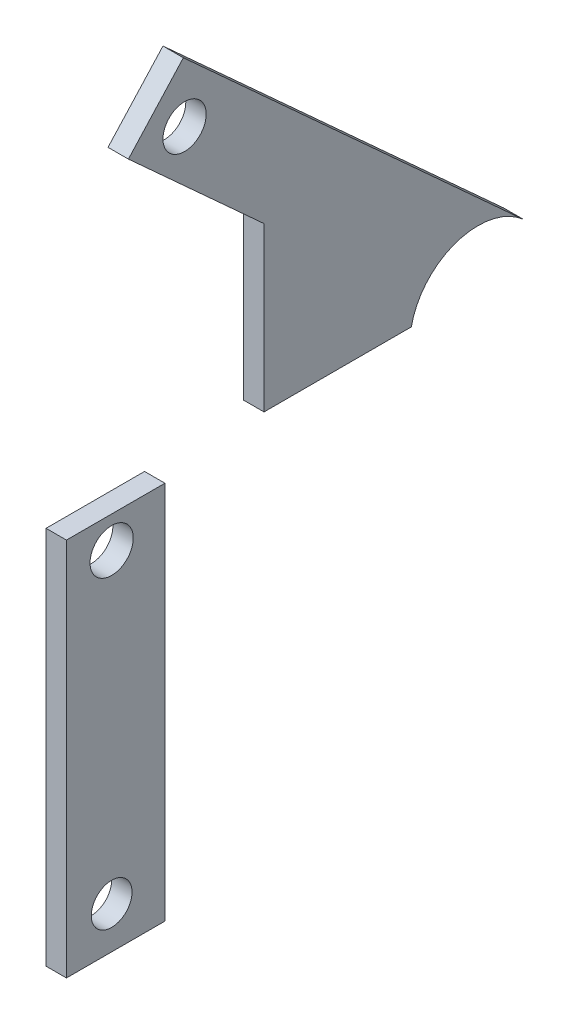
ISO-10303-21;
HEADER;
FILE_DESCRIPTION(('STEP AP214'),'2;1');
FILE_NAME('part.step','',(''),(''),'','','');
FILE_SCHEMA(('AUTOMOTIVE_DESIGN { 1 0 10303 214 1 1 1 1 }'));
ENDSEC;
DATA;
#1=APPLICATION_CONTEXT('core data for automotive mechanical design processes');
#2=APPLICATION_PROTOCOL_DEFINITION('international standard','automotive_design',2000,#1);
#3=PRODUCT_CONTEXT('',#1,'mechanical');
#4=PRODUCT('Part','Part','',(#3));
#5=PRODUCT_RELATED_PRODUCT_CATEGORY('part','',(#4));
#6=PRODUCT_DEFINITION_FORMATION('','',#4);
#7=PRODUCT_DEFINITION_CONTEXT('part definition',#1,'design');
#8=PRODUCT_DEFINITION('design','',#6,#7);
#9=PRODUCT_DEFINITION_SHAPE('','',#8);
#10=(LENGTH_UNIT() NAMED_UNIT(*) SI_UNIT(.MILLI.,.METRE.));
#11=(NAMED_UNIT(*) PLANE_ANGLE_UNIT() SI_UNIT($,.RADIAN.));
#12=(NAMED_UNIT(*) SI_UNIT($,.STERADIAN.) SOLID_ANGLE_UNIT());
#13=UNCERTAINTY_MEASURE_WITH_UNIT(LENGTH_MEASURE(1.E-05),#10,'distance_accuracy_value','');
#14=(GEOMETRIC_REPRESENTATION_CONTEXT(3) GLOBAL_UNCERTAINTY_ASSIGNED_CONTEXT((#13)) GLOBAL_UNIT_ASSIGNED_CONTEXT((#10,
#11,#12)) REPRESENTATION_CONTEXT('',''));
#15=CARTESIAN_POINT('',(0.,0.,0.));
#16=DIRECTION('',(0.,0.,1.));
#17=DIRECTION('',(1.,0.,0.));
#18=AXIS2_PLACEMENT_3D('',#15,#16,#17);
#19=CARTESIAN_POINT('',(5.,0.,0.));
#20=DIRECTION('',(-1.,0.,0.));
#21=DIRECTION('',(0.,0.,1.));
#22=AXIS2_PLACEMENT_3D('',#19,#20,#21);
#23=PLANE('',#22);
#24=CARTESIAN_POINT('',(5.,-5.82701027654988,27.5312744206967));
#25=DIRECTION('',(1.,0.,0.));
#26=DIRECTION('',(0.,0.,-1.));
#27=AXIS2_PLACEMENT_3D('',#24,#25,#26);
#28=CIRCLE('',#27,5.29999999998592);
#29=CARTESIAN_POINT('',(5.,-5.82701027654988,22.2312744207108));
#30=VERTEX_POINT('',#29);
#31=EDGE_CURVE('E110',#30,#30,#28,.T.);
#32=ORIENTED_EDGE('',*,*,#31,.F.);
#33=EDGE_LOOP('',(#32));
#34=FACE_BOUND('',#33,.T.);
#35=DIRECTION('',(0.,-1.,0.));
#36=VECTOR('',#35,1.);
#37=CARTESIAN_POINT('',(5.,-91.0615293843236,38.611464773439));
#38=LINE('',#37,#36);
#39=CARTESIAN_POINT('',(5.,1.92614191237001,38.6114647734391));
#40=VERTEX_POINT('',#39);
#41=CARTESIAN_POINT('',(5.,-91.0615293843236,38.611464773439));
#42=VERTEX_POINT('',#41);
#43=EDGE_CURVE('E95',#40,#42,#38,.T.);
#44=ORIENTED_EDGE('',*,*,#43,.T.);
#45=DIRECTION('',(0.,0.,-1.));
#46=VECTOR('',#45,1.);
#47=CARTESIAN_POINT('',(5.,-91.0615293843236,14.4672974893852));
#48=LINE('',#47,#46);
#49=CARTESIAN_POINT('',(5.,-91.0615293843236,14.4672974893852));
#50=VERTEX_POINT('',#49);
#51=EDGE_CURVE('E90',#42,#50,#48,.T.);
#52=ORIENTED_EDGE('',*,*,#51,.T.);
#53=DIRECTION('',(0.,1.,0.));
#54=VECTOR('',#53,1.);
#55=CARTESIAN_POINT('',(5.,1.92614191237001,14.4672974893852));
#56=LINE('',#55,#54);
#57=CARTESIAN_POINT('',(5.,1.92614191237001,14.4672974893852));
#58=VERTEX_POINT('',#57);
#59=EDGE_CURVE('E93',#50,#58,#56,.T.);
#60=ORIENTED_EDGE('',*,*,#59,.T.);
#61=DIRECTION('',(0.,0.,1.));
#62=VECTOR('',#61,1.);
#63=CARTESIAN_POINT('',(5.,1.92614191237001,38.6114647734391));
#64=LINE('',#63,#62);
#65=EDGE_CURVE('E60',#58,#40,#64,.T.);
#66=ORIENTED_EDGE('',*,*,#65,.T.);
#67=EDGE_LOOP('',(#44,#52,#60,#66));
#68=FACE_BOUND('',#67,.T.);
#69=CARTESIAN_POINT('',(5.,-80.8528128642009,27.5312744206967));
#70=DIRECTION('',(1.,0.,0.));
#71=DIRECTION('',(0.,0.,-1.));
#72=AXIS2_PLACEMENT_3D('',#69,#70,#71);
#73=CIRCLE('',#72,4.99999999999999);
#74=CARTESIAN_POINT('',(5.,-80.8528128642009,22.5312744206967));
#75=VERTEX_POINT('',#74);
#76=EDGE_CURVE('E125',#75,#75,#73,.T.);
#77=ORIENTED_EDGE('',*,*,#76,.F.);
#78=EDGE_LOOP('',(#77));
#79=FACE_BOUND('',#78,.T.);
#80=ADVANCED_FACE('F43',(#34,#68,#79),#23,.F.);
#81=CARTESIAN_POINT('',(0.,0.,0.));
#82=DIRECTION('',(-1.,0.,0.));
#83=DIRECTION('',(0.,0.,1.));
#84=AXIS2_PLACEMENT_3D('',#81,#82,#83);
#85=PLANE('',#84);
#86=CARTESIAN_POINT('',(0.,-5.82701027654988,27.5312744206967));
#87=DIRECTION('',(1.,0.,0.));
#88=DIRECTION('',(0.,0.,-1.));
#89=AXIS2_PLACEMENT_3D('',#86,#87,#88);
#90=CIRCLE('',#89,5.29999999998592);
#91=CARTESIAN_POINT('',(0.,-5.82701027654988,22.2312744207108));
#92=VERTEX_POINT('',#91);
#93=EDGE_CURVE('E122',#92,#92,#90,.T.);
#94=ORIENTED_EDGE('',*,*,#93,.T.);
#95=EDGE_LOOP('',(#94));
#96=FACE_BOUND('',#95,.T.);
#97=DIRECTION('',(0.,-1.,0.));
#98=VECTOR('',#97,1.);
#99=CARTESIAN_POINT('',(0.,-91.0615293843236,38.611464773439));
#100=LINE('',#99,#98);
#101=CARTESIAN_POINT('',(0.,1.92614191237001,38.6114647734391));
#102=VERTEX_POINT('',#101);
#103=CARTESIAN_POINT('',(0.,-91.0615293843236,38.611464773439));
#104=VERTEX_POINT('',#103);
#105=EDGE_CURVE('E107',#102,#104,#100,.T.);
#106=ORIENTED_EDGE('',*,*,#105,.F.);
#107=DIRECTION('',(0.,0.,1.));
#108=VECTOR('',#107,1.);
#109=CARTESIAN_POINT('',(0.,1.92614191237001,38.6114647734391));
#110=LINE('',#109,#108);
#111=CARTESIAN_POINT('',(0.,1.92614191237001,14.4672974893852));
#112=VERTEX_POINT('',#111);
#113=EDGE_CURVE('E83',#112,#102,#110,.T.);
#114=ORIENTED_EDGE('',*,*,#113,.F.);
#115=DIRECTION('',(0.,1.,0.));
#116=VECTOR('',#115,1.);
#117=CARTESIAN_POINT('',(0.,1.92614191237001,14.4672974893852));
#118=LINE('',#117,#116);
#119=CARTESIAN_POINT('',(0.,-91.0615293843236,14.4672974893852));
#120=VERTEX_POINT('',#119);
#121=EDGE_CURVE('E77',#120,#112,#118,.T.);
#122=ORIENTED_EDGE('',*,*,#121,.F.);
#123=DIRECTION('',(0.,0.,-1.));
#124=VECTOR('',#123,1.);
#125=CARTESIAN_POINT('',(0.,-91.0615293843236,14.4672974893852));
#126=LINE('',#125,#124);
#127=EDGE_CURVE('E99',#104,#120,#126,.T.);
#128=ORIENTED_EDGE('',*,*,#127,.F.);
#129=EDGE_LOOP('',(#106,#114,#122,#128));
#130=FACE_BOUND('',#129,.T.);
#131=CARTESIAN_POINT('',(0.,-80.8528128642009,27.5312744206967));
#132=DIRECTION('',(1.,0.,0.));
#133=DIRECTION('',(0.,0.,-1.));
#134=AXIS2_PLACEMENT_3D('',#131,#132,#133);
#135=CIRCLE('',#134,4.99999999999999);
#136=CARTESIAN_POINT('',(0.,-80.8528128642009,22.5312744206967));
#137=VERTEX_POINT('',#136);
#138=EDGE_CURVE('E128',#137,#137,#135,.T.);
#139=ORIENTED_EDGE('',*,*,#138,.T.);
#140=EDGE_LOOP('',(#139));
#141=FACE_BOUND('',#140,.T.);
#142=ADVANCED_FACE('F118',(#96,#130,#141),#85,.T.);
#143=CARTESIAN_POINT('',(5.,-91.0615293843236,38.611464773439));
#144=DIRECTION('',(0.,0.,-1.));
#145=DIRECTION('',(0.,1.,0.));
#146=AXIS2_PLACEMENT_3D('',#143,#144,#145);
#147=PLANE('',#146);
#148=ORIENTED_EDGE('',*,*,#105,.T.);
#149=DIRECTION('',(-1.,0.,0.));
#150=VECTOR('',#149,1.);
#151=CARTESIAN_POINT('',(5.,-91.0615293843236,38.611464773439));
#152=LINE('',#151,#150);
#153=EDGE_CURVE('E12',#42,#104,#152,.T.);
#154=ORIENTED_EDGE('',*,*,#153,.F.);
#155=ORIENTED_EDGE('',*,*,#43,.F.);
#156=DIRECTION('',(-1.,0.,0.));
#157=VECTOR('',#156,1.);
#158=CARTESIAN_POINT('',(5.,1.92614191237001,38.6114647734391));
#159=LINE('',#158,#157);
#160=EDGE_CURVE('E103',#40,#102,#159,.T.);
#161=ORIENTED_EDGE('',*,*,#160,.T.);
#162=EDGE_LOOP('',(#148,#154,#155,#161));
#163=FACE_BOUND('',#162,.T.);
#164=ADVANCED_FACE('F45',(#163),#147,.F.);
#165=CARTESIAN_POINT('',(5.,-91.0615293843236,14.4672974893852));
#166=DIRECTION('',(0.,1.,0.));
#167=DIRECTION('',(0.,0.,1.));
#168=AXIS2_PLACEMENT_3D('',#165,#166,#167);
#169=PLANE('',#168);
#170=ORIENTED_EDGE('',*,*,#127,.T.);
#171=DIRECTION('',(-1.,0.,0.));
#172=VECTOR('',#171,1.);
#173=CARTESIAN_POINT('',(5.,-91.0615293843236,14.4672974893852));
#174=LINE('',#173,#172);
#175=EDGE_CURVE('E52',#50,#120,#174,.T.);
#176=ORIENTED_EDGE('',*,*,#175,.F.);
#177=ORIENTED_EDGE('',*,*,#51,.F.);
#178=ORIENTED_EDGE('',*,*,#153,.T.);
#179=EDGE_LOOP('',(#170,#176,#177,#178));
#180=FACE_BOUND('',#179,.T.);
#181=ADVANCED_FACE('F98',(#180),#169,.F.);
#182=CARTESIAN_POINT('',(5.,1.92614191237001,14.4672974893852));
#183=DIRECTION('',(0.,0.,1.));
#184=DIRECTION('',(1.,0.,0.));
#185=AXIS2_PLACEMENT_3D('',#182,#183,#184);
#186=PLANE('',#185);
#187=ORIENTED_EDGE('',*,*,#121,.T.);
#188=DIRECTION('',(-1.,0.,0.));
#189=VECTOR('',#188,1.);
#190=CARTESIAN_POINT('',(5.,1.92614191237001,14.4672974893852));
#191=LINE('',#190,#189);
#192=EDGE_CURVE('E100',#58,#112,#191,.T.);
#193=ORIENTED_EDGE('',*,*,#192,.F.);
#194=ORIENTED_EDGE('',*,*,#59,.F.);
#195=ORIENTED_EDGE('',*,*,#175,.T.);
#196=EDGE_LOOP('',(#187,#193,#194,#195));
#197=FACE_BOUND('',#196,.T.);
#198=ADVANCED_FACE('F101',(#197),#186,.F.);
#199=CARTESIAN_POINT('',(5.,1.92614191237001,38.6114647734391));
#200=DIRECTION('',(0.,-1.,0.));
#201=DIRECTION('',(0.,0.,-1.));
#202=AXIS2_PLACEMENT_3D('',#199,#200,#201);
#203=PLANE('',#202);
#204=ORIENTED_EDGE('',*,*,#113,.T.);
#205=ORIENTED_EDGE('',*,*,#160,.F.);
#206=ORIENTED_EDGE('',*,*,#65,.F.);
#207=ORIENTED_EDGE('',*,*,#192,.T.);
#208=EDGE_LOOP('',(#204,#205,#206,#207));
#209=FACE_BOUND('',#208,.T.);
#210=ADVANCED_FACE('F115',(#209),#203,.F.);
#211=CARTESIAN_POINT('',(5.,-5.82701027654988,27.5312744206967));
#212=DIRECTION('',(-1.,0.,0.));
#213=DIRECTION('',(0.,0.,1.));
#214=AXIS2_PLACEMENT_3D('',#211,#212,#213);
#215=CYLINDRICAL_SURFACE('',#214,5.29999999998592);
#216=ORIENTED_EDGE('',*,*,#31,.T.);
#217=EDGE_LOOP('',(#216));
#218=FACE_BOUND('',#217,.T.);
#219=ORIENTED_EDGE('',*,*,#93,.F.);
#220=EDGE_LOOP('',(#219));
#221=FACE_BOUND('',#220,.T.);
#222=ADVANCED_FACE('F146',(#218,#221),#215,.F.);
#223=CARTESIAN_POINT('',(5.,-80.8528128642009,27.5312744206967));
#224=DIRECTION('',(-1.,0.,0.));
#225=DIRECTION('',(0.,0.,1.));
#226=AXIS2_PLACEMENT_3D('',#223,#224,#225);
#227=CYLINDRICAL_SURFACE('',#226,4.99999999999999);
#228=ORIENTED_EDGE('',*,*,#76,.T.);
#229=EDGE_LOOP('',(#228));
#230=FACE_BOUND('',#229,.T.);
#231=ORIENTED_EDGE('',*,*,#138,.F.);
#232=EDGE_LOOP('',(#231));
#233=FACE_BOUND('',#232,.T.);
#234=ADVANCED_FACE('F134',(#230,#233),#227,.F.);
#235=CLOSED_SHELL('',(#80,#142,#164,#181,#198,#210,#222,#234));
#236=MANIFOLD_SOLID_BREP('B2',#235);
#237=CARTESIAN_POINT('',(5.,1.53145744647893,-62.3066516059492));
#238=DIRECTION('',(1.,0.,0.));
#239=DIRECTION('',(0.,0.,-1.));
#240=AXIS2_PLACEMENT_3D('',#237,#238,#239);
#241=PLANE('',#240);
#242=CARTESIAN_POINT('',(5.,1.53145744647893,-62.3066516059492));
#243=DIRECTION('',(-1.,0.,0.));
#244=DIRECTION('',(0.,0.,-1.));
#245=AXIS2_PLACEMENT_3D('',#242,#243,#244);
#246=CIRCLE('',#245,16.7005);
#247=CARTESIAN_POINT('',(5.,4.90440919987179,-45.9503104283115));
#248=VERTEX_POINT('',#247);
#249=CARTESIAN_POINT('',(5.,13.8732741730434,-73.5577075625203));
#250=VERTEX_POINT('',#249);
#251=EDGE_CURVE('E305',#248,#250,#246,.T.);
#252=ORIENTED_EDGE('',*,*,#251,.T.);
#253=DIRECTION('',(0.,0.673695755011594,0.739008815697999));
#254=VECTOR('',#253,1.);
#255=CARTESIAN_POINT('',(5.,13.8732741730434,-73.5577075625203));
#256=LINE('',#255,#254);
#257=CARTESIAN_POINT('',(5.,90.0008944893535,9.95028861135355));
#258=VERTEX_POINT('',#257);
#259=EDGE_CURVE('E263',#250,#258,#256,.T.);
#260=ORIENTED_EDGE('',*,*,#259,.T.);
#261=DIRECTION('',(0.,-0.739008815697999,0.673695755011594));
#262=VECTOR('',#261,1.);
#263=CARTESIAN_POINT('',(5.,90.0008944893535,9.95028861135355));
#264=LINE('',#263,#262);
#265=CARTESIAN_POINT('',(5.,75.2207181753935,23.4242037115854));
#266=VERTEX_POINT('',#265);
#267=EDGE_CURVE('E276',#258,#266,#264,.T.);
#268=ORIENTED_EDGE('',*,*,#267,.T.);
#269=DIRECTION('',(0.,-0.673695755011594,-0.739008815697998));
#270=VECTOR('',#269,1.);
#271=CARTESIAN_POINT('',(5.,75.2207181753935,23.4242037115854));
#272=LINE('',#271,#270);
#273=CARTESIAN_POINT('',(5.,44.9044091998718,-9.83119299482449));
#274=VERTEX_POINT('',#273);
#275=EDGE_CURVE('E270',#266,#274,#272,.T.);
#276=ORIENTED_EDGE('',*,*,#275,.T.);
#277=DIRECTION('',(0.,-1.,0.));
#278=VECTOR('',#277,1.);
#279=CARTESIAN_POINT('',(5.,44.9044091998718,-9.83119299482449));
#280=LINE('',#279,#278);
#281=CARTESIAN_POINT('',(5.,4.90440919987177,-9.83119299482452));
#282=VERTEX_POINT('',#281);
#283=EDGE_CURVE('E274',#274,#282,#280,.T.);
#284=ORIENTED_EDGE('',*,*,#283,.T.);
#285=DIRECTION('',(0.,0.,-1.));
#286=VECTOR('',#285,1.);
#287=CARTESIAN_POINT('',(5.,4.90440919987177,-9.83119299482452));
#288=LINE('',#287,#286);
#289=EDGE_CURVE('E226',#282,#248,#288,.T.);
#290=ORIENTED_EDGE('',*,*,#289,.T.);
#291=EDGE_LOOP('',(#252,#260,#268,#276,#284,#290));
#292=FACE_BOUND('',#291,.T.);
#293=CARTESIAN_POINT('',(5.,75.2403033549509,9.65105895188523));
#294=DIRECTION('',(1.,0.,0.));
#295=DIRECTION('',(0.,0.,-1.));
#296=AXIS2_PLACEMENT_3D('',#293,#294,#295);
#297=CIRCLE('',#296,5.29999999998581);
#298=CARTESIAN_POINT('',(5.,75.2403033549509,4.35105895189942));
#299=VERTEX_POINT('',#298);
#300=EDGE_CURVE('E298',#299,#299,#297,.T.);
#301=ORIENTED_EDGE('',*,*,#300,.F.);
#302=EDGE_LOOP('',(#301));
#303=FACE_BOUND('',#302,.T.);
#304=ADVANCED_FACE('F209',(#292,#303),#241,.T.);
#305=CARTESIAN_POINT('',(0.,1.53145744647893,-62.3066516059492));
#306=DIRECTION('',(1.,0.,0.));
#307=DIRECTION('',(0.,0.,-1.));
#308=AXIS2_PLACEMENT_3D('',#305,#306,#307);
#309=PLANE('',#308);
#310=CARTESIAN_POINT('',(0.,1.53145744647893,-62.3066516059492));
#311=DIRECTION('',(-1.,0.,0.));
#312=DIRECTION('',(0.,0.,-1.));
#313=AXIS2_PLACEMENT_3D('',#310,#311,#312);
#314=CIRCLE('',#313,16.7005);
#315=CARTESIAN_POINT('',(0.,4.90440919987179,-45.9503104283115));
#316=VERTEX_POINT('',#315);
#317=CARTESIAN_POINT('',(0.,13.8732741730434,-73.5577075625203));
#318=VERTEX_POINT('',#317);
#319=EDGE_CURVE('E294',#316,#318,#314,.T.);
#320=ORIENTED_EDGE('',*,*,#319,.F.);
#321=DIRECTION('',(0.,0.,-1.));
#322=VECTOR('',#321,1.);
#323=CARTESIAN_POINT('',(0.,4.90440919987177,-9.83119299482452));
#324=LINE('',#323,#322);
#325=CARTESIAN_POINT('',(0.,4.90440919987177,-9.83119299482452));
#326=VERTEX_POINT('',#325);
#327=EDGE_CURVE('E255',#326,#316,#324,.T.);
#328=ORIENTED_EDGE('',*,*,#327,.F.);
#329=DIRECTION('',(0.,-1.,0.));
#330=VECTOR('',#329,1.);
#331=CARTESIAN_POINT('',(0.,44.9044091998718,-9.83119299482449));
#332=LINE('',#331,#330);
#333=CARTESIAN_POINT('',(0.,44.9044091998718,-9.83119299482449));
#334=VERTEX_POINT('',#333);
#335=EDGE_CURVE('E249',#334,#326,#332,.T.);
#336=ORIENTED_EDGE('',*,*,#335,.F.);
#337=DIRECTION('',(0.,-0.673695755011594,-0.739008815697998));
#338=VECTOR('',#337,1.);
#339=CARTESIAN_POINT('',(0.,75.2207181753935,23.4242037115854));
#340=LINE('',#339,#338);
#341=CARTESIAN_POINT('',(0.,75.2207181753935,23.4242037115854));
#342=VERTEX_POINT('',#341);
#343=EDGE_CURVE('E284',#342,#334,#340,.T.);
#344=ORIENTED_EDGE('',*,*,#343,.F.);
#345=DIRECTION('',(0.,-0.739008815697999,0.673695755011594));
#346=VECTOR('',#345,1.);
#347=CARTESIAN_POINT('',(0.,90.0008944893535,9.95028861135355));
#348=LINE('',#347,#346);
#349=CARTESIAN_POINT('',(0.,90.0008944893535,9.95028861135355));
#350=VERTEX_POINT('',#349);
#351=EDGE_CURVE('E300',#350,#342,#348,.T.);
#352=ORIENTED_EDGE('',*,*,#351,.F.);
#353=DIRECTION('',(0.,0.673695755011594,0.739008815697999));
#354=VECTOR('',#353,1.);
#355=CARTESIAN_POINT('',(0.,13.8732741730434,-73.5577075625203));
#356=LINE('',#355,#354);
#357=EDGE_CURVE('E297',#318,#350,#356,.T.);
#358=ORIENTED_EDGE('',*,*,#357,.F.);
#359=EDGE_LOOP('',(#320,#328,#336,#344,#352,#358));
#360=FACE_BOUND('',#359,.T.);
#361=CARTESIAN_POINT('',(0.,75.2403033549509,9.65105895188523));
#362=DIRECTION('',(1.,0.,0.));
#363=DIRECTION('',(0.,0.,-1.));
#364=AXIS2_PLACEMENT_3D('',#361,#362,#363);
#365=CIRCLE('',#364,5.29999999998581);
#366=CARTESIAN_POINT('',(0.,75.2403033549509,4.35105895189942));
#367=VERTEX_POINT('',#366);
#368=EDGE_CURVE('E398',#367,#367,#365,.T.);
#369=ORIENTED_EDGE('',*,*,#368,.T.);
#370=EDGE_LOOP('',(#369));
#371=FACE_BOUND('',#370,.T.);
#372=ADVANCED_FACE('F314',(#360,#371),#309,.F.);
#373=CARTESIAN_POINT('',(5.,1.53145744647893,-62.3066516059492));
#374=DIRECTION('',(-1.,0.,0.));
#375=DIRECTION('',(0.,0.,1.));
#376=AXIS2_PLACEMENT_3D('',#373,#374,#375);
#377=CYLINDRICAL_SURFACE('',#376,16.7005);
#378=ORIENTED_EDGE('',*,*,#319,.T.);
#379=DIRECTION('',(-1.,0.,0.));
#380=VECTOR('',#379,1.);
#381=CARTESIAN_POINT('',(5.,13.8732741730434,-73.5577075625203));
#382=LINE('',#381,#380);
#383=EDGE_CURVE('E41',#250,#318,#382,.T.);
#384=ORIENTED_EDGE('',*,*,#383,.F.);
#385=ORIENTED_EDGE('',*,*,#251,.F.);
#386=DIRECTION('',(-1.,0.,0.));
#387=VECTOR('',#386,1.);
#388=CARTESIAN_POINT('',(5.,4.90440919987179,-45.9503104283115));
#389=LINE('',#388,#387);
#390=EDGE_CURVE('E290',#248,#316,#389,.T.);
#391=ORIENTED_EDGE('',*,*,#390,.T.);
#392=EDGE_LOOP('',(#378,#384,#385,#391));
#393=FACE_BOUND('',#392,.T.);
#394=ADVANCED_FACE('F211',(#393),#377,.F.);
#395=CARTESIAN_POINT('',(5.,13.8732741730434,-73.5577075625203));
#396=DIRECTION('',(0.,-0.739008815697999,0.673695755011594));
#397=DIRECTION('',(0.,-0.673695755011594,-0.739008815697999));
#398=AXIS2_PLACEMENT_3D('',#395,#396,#397);
#399=PLANE('',#398);
#400=ORIENTED_EDGE('',*,*,#357,.T.);
#401=DIRECTION('',(-1.,0.,0.));
#402=VECTOR('',#401,1.);
#403=CARTESIAN_POINT('',(5.,90.0008944893535,9.95028861135355));
#404=LINE('',#403,#402);
#405=EDGE_CURVE('E218',#258,#350,#404,.T.);
#406=ORIENTED_EDGE('',*,*,#405,.F.);
#407=ORIENTED_EDGE('',*,*,#259,.F.);
#408=ORIENTED_EDGE('',*,*,#383,.T.);
#409=EDGE_LOOP('',(#400,#406,#407,#408));
#410=FACE_BOUND('',#409,.T.);
#411=ADVANCED_FACE('F339',(#410),#399,.F.);
#412=CARTESIAN_POINT('',(5.,90.0008944893535,9.95028861135355));
#413=DIRECTION('',(0.,-0.673695755011594,-0.739008815697999));
#414=DIRECTION('',(0.,0.739008815697999,-0.673695755011594));
#415=AXIS2_PLACEMENT_3D('',#412,#413,#414);
#416=PLANE('',#415);
#417=ORIENTED_EDGE('',*,*,#351,.T.);
#418=DIRECTION('',(-1.,0.,0.));
#419=VECTOR('',#418,1.);
#420=CARTESIAN_POINT('',(5.,75.2207181753935,23.4242037115854));
#421=LINE('',#420,#419);
#422=EDGE_CURVE('E285',#266,#342,#421,.T.);
#423=ORIENTED_EDGE('',*,*,#422,.F.);
#424=ORIENTED_EDGE('',*,*,#267,.F.);
#425=ORIENTED_EDGE('',*,*,#405,.T.);
#426=EDGE_LOOP('',(#417,#423,#424,#425));
#427=FACE_BOUND('',#426,.T.);
#428=ADVANCED_FACE('F311',(#427),#416,.F.);
#429=CARTESIAN_POINT('',(5.,75.2207181753935,23.4242037115854));
#430=DIRECTION('',(0.,0.739008815697998,-0.673695755011594));
#431=DIRECTION('',(0.,0.673695755011594,0.739008815697998));
#432=AXIS2_PLACEMENT_3D('',#429,#430,#431);
#433=PLANE('',#432);
#434=ORIENTED_EDGE('',*,*,#343,.T.);
#435=DIRECTION('',(-1.,0.,0.));
#436=VECTOR('',#435,1.);
#437=CARTESIAN_POINT('',(5.,44.9044091998718,-9.83119299482449));
#438=LINE('',#437,#436);
#439=EDGE_CURVE('E281',#274,#334,#438,.T.);
#440=ORIENTED_EDGE('',*,*,#439,.F.);
#441=ORIENTED_EDGE('',*,*,#275,.F.);
#442=ORIENTED_EDGE('',*,*,#422,.T.);
#443=EDGE_LOOP('',(#434,#440,#441,#442));
#444=FACE_BOUND('',#443,.T.);
#445=ADVANCED_FACE('F282',(#444),#433,.F.);
#446=CARTESIAN_POINT('',(5.,44.9044091998718,-9.83119299482449));
#447=DIRECTION('',(0.,0.,-1.));
#448=DIRECTION('',(0.,1.,0.));
#449=AXIS2_PLACEMENT_3D('',#446,#447,#448);
#450=PLANE('',#449);
#451=ORIENTED_EDGE('',*,*,#335,.T.);
#452=DIRECTION('',(-1.,0.,0.));
#453=VECTOR('',#452,1.);
#454=CARTESIAN_POINT('',(5.,4.90440919987177,-9.83119299482452));
#455=LINE('',#454,#453);
#456=EDGE_CURVE('E286',#282,#326,#455,.T.);
#457=ORIENTED_EDGE('',*,*,#456,.F.);
#458=ORIENTED_EDGE('',*,*,#283,.F.);
#459=ORIENTED_EDGE('',*,*,#439,.T.);
#460=EDGE_LOOP('',(#451,#457,#458,#459));
#461=FACE_BOUND('',#460,.T.);
#462=ADVANCED_FACE('F288',(#461),#450,.F.);
#463=CARTESIAN_POINT('',(5.,4.90440919987177,-9.83119299482452));
#464=DIRECTION('',(0.,1.,0.));
#465=DIRECTION('',(0.,0.,1.));
#466=AXIS2_PLACEMENT_3D('',#463,#464,#465);
#467=PLANE('',#466);
#468=ORIENTED_EDGE('',*,*,#327,.T.);
#469=ORIENTED_EDGE('',*,*,#390,.F.);
#470=ORIENTED_EDGE('',*,*,#289,.F.);
#471=ORIENTED_EDGE('',*,*,#456,.T.);
#472=EDGE_LOOP('',(#468,#469,#470,#471));
#473=FACE_BOUND('',#472,.T.);
#474=ADVANCED_FACE('F319',(#473),#467,.F.);
#475=CARTESIAN_POINT('',(5.,75.2403033549509,9.65105895188523));
#476=DIRECTION('',(-1.,0.,0.));
#477=DIRECTION('',(0.,0.,1.));
#478=AXIS2_PLACEMENT_3D('',#475,#476,#477);
#479=CYLINDRICAL_SURFACE('',#478,5.29999999998581);
#480=ORIENTED_EDGE('',*,*,#300,.T.);
#481=EDGE_LOOP('',(#480));
#482=FACE_BOUND('',#481,.T.);
#483=ORIENTED_EDGE('',*,*,#368,.F.);
#484=EDGE_LOOP('',(#483));
#485=FACE_BOUND('',#484,.T.);
#486=ADVANCED_FACE('F321',(#482,#485),#479,.F.);
#487=CLOSED_SHELL('',(#304,#372,#394,#411,#428,#445,#462,#474,#486));
#488=MANIFOLD_SOLID_BREP('B6',#487);
#489=ADVANCED_BREP_SHAPE_REPRESENTATION('',(#18,#236,#488),#14);
#490=SHAPE_DEFINITION_REPRESENTATION(#9,#489);
ENDSEC;
END-ISO-10303-21;
